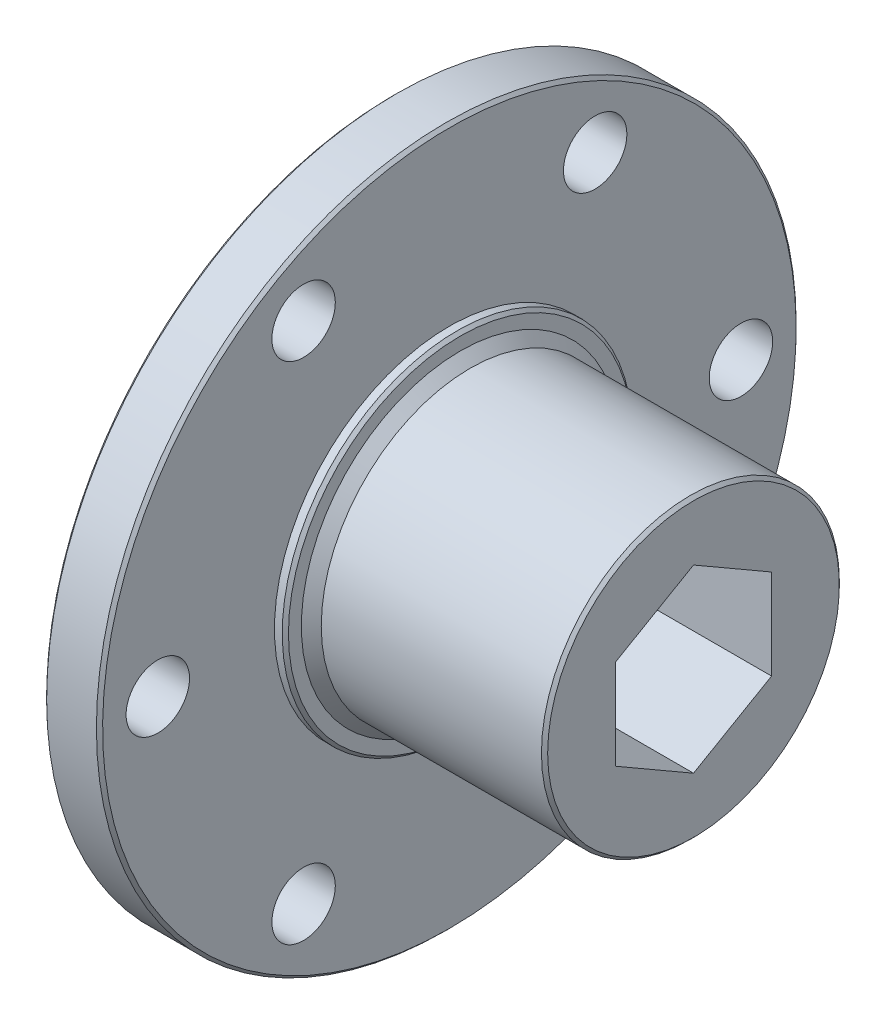
ISO-10303-21;
HEADER;
FILE_DESCRIPTION(('STEP AP214'),'2;1');
FILE_NAME('part.step','',(''),(''),'','','');
FILE_SCHEMA(('AUTOMOTIVE_DESIGN { 1 0 10303 214 1 1 1 1 }'));
ENDSEC;
DATA;
#1=APPLICATION_CONTEXT('core data for automotive mechanical design processes');
#2=APPLICATION_PROTOCOL_DEFINITION('international standard','automotive_design',2000,#1);
#3=PRODUCT_CONTEXT('',#1,'mechanical');
#4=PRODUCT('Part','Part','',(#3));
#5=PRODUCT_RELATED_PRODUCT_CATEGORY('part','',(#4));
#6=PRODUCT_DEFINITION_FORMATION('','',#4);
#7=PRODUCT_DEFINITION_CONTEXT('part definition',#1,'design');
#8=PRODUCT_DEFINITION('design','',#6,#7);
#9=PRODUCT_DEFINITION_SHAPE('','',#8);
#10=(LENGTH_UNIT() NAMED_UNIT(*) SI_UNIT(.MILLI.,.METRE.));
#11=(NAMED_UNIT(*) PLANE_ANGLE_UNIT() SI_UNIT($,.RADIAN.));
#12=(NAMED_UNIT(*) SI_UNIT($,.STERADIAN.) SOLID_ANGLE_UNIT());
#13=UNCERTAINTY_MEASURE_WITH_UNIT(LENGTH_MEASURE(1.E-05),#10,'distance_accuracy_value','');
#14=(GEOMETRIC_REPRESENTATION_CONTEXT(3) GLOBAL_UNCERTAINTY_ASSIGNED_CONTEXT((#13)) GLOBAL_UNIT_ASSIGNED_CONTEXT((#10,
#11,#12)) REPRESENTATION_CONTEXT('',''));
#15=CARTESIAN_POINT('',(0.,0.,0.));
#16=DIRECTION('',(0.,0.,1.));
#17=DIRECTION('',(1.,0.,0.));
#18=AXIS2_PLACEMENT_3D('',#15,#16,#17);
#19=CARTESIAN_POINT('',(6.01493375394323,0.,0.));
#20=DIRECTION('',(-1.,0.,0.));
#21=DIRECTION('',(0.,0.,1.));
#22=AXIS2_PLACEMENT_3D('',#19,#20,#21);
#23=CYLINDRICAL_SURFACE('',#22,12.1666);
#24=CARTESIAN_POINT('',(5.76093375394327,0.,0.));
#25=DIRECTION('',(-1.,0.,0.));
#26=DIRECTION('',(0.,0.,1.));
#27=AXIS2_PLACEMENT_3D('',#24,#25,#26);
#28=CIRCLE('',#27,12.1666);
#29=CARTESIAN_POINT('',(5.76093375394327,0.,12.1666));
#30=VERTEX_POINT('',#29);
#31=EDGE_CURVE('E101',#30,#30,#28,.F.);
#32=ORIENTED_EDGE('',*,*,#31,.F.);
#33=EDGE_LOOP('',(#32));
#34=FACE_BOUND('',#33,.T.);
#35=CARTESIAN_POINT('',(-12.2222662460567,0.,0.));
#36=DIRECTION('',(-1.,0.,0.));
#37=DIRECTION('',(0.,0.,1.));
#38=AXIS2_PLACEMENT_3D('',#35,#36,#37);
#39=CIRCLE('',#38,12.1666);
#40=CARTESIAN_POINT('',(-12.2222662460567,0.,12.1666));
#41=VERTEX_POINT('',#40);
#42=EDGE_CURVE('E98',#41,#41,#39,.T.);
#43=ORIENTED_EDGE('',*,*,#42,.F.);
#44=EDGE_LOOP('',(#43));
#45=FACE_BOUND('',#44,.T.);
#46=ADVANCED_FACE('F17',(#34,#45),#23,.T.);
#47=CARTESIAN_POINT('',(5.76093375394327,0.,0.));
#48=DIRECTION('',(-1.,0.,0.));
#49=DIRECTION('',(0.,0.,1.));
#50=AXIS2_PLACEMENT_3D('',#47,#48,#49);
#51=CONICAL_SURFACE('',#50,12.1666,0.785398163397465);
#52=ORIENTED_EDGE('',*,*,#31,.T.);
#53=EDGE_LOOP('',(#52));
#54=FACE_BOUND('',#53,.T.);
#55=CARTESIAN_POINT('',(6.01493375394323,0.,0.));
#56=DIRECTION('',(-1.,0.,0.));
#57=DIRECTION('',(0.,0.,1.));
#58=AXIS2_PLACEMENT_3D('',#55,#56,#57);
#59=CIRCLE('',#58,11.9126);
#60=CARTESIAN_POINT('',(6.01493375394323,0.,11.9126));
#61=VERTEX_POINT('',#60);
#62=EDGE_CURVE('E20',#61,#61,#59,.F.);
#63=ORIENTED_EDGE('',*,*,#62,.F.);
#64=EDGE_LOOP('',(#63));
#65=FACE_BOUND('',#64,.T.);
#66=ADVANCED_FACE('F164',(#54,#65),#51,.T.);
#67=CARTESIAN_POINT('',(-13.0350662460568,0.,0.));
#68=DIRECTION('',(-1.,0.,0.));
#69=DIRECTION('',(0.,-1.,0.));
#70=AXIS2_PLACEMENT_3D('',#67,#68,#69);
#71=CONICAL_SURFACE('',#70,12.9794,0.785398163397438);
#72=ORIENTED_EDGE('',*,*,#42,.T.);
#73=EDGE_LOOP('',(#72));
#74=FACE_BOUND('',#73,.T.);
#75=CARTESIAN_POINT('',(-13.0350662460568,0.,0.));
#76=DIRECTION('',(-1.,0.,0.));
#77=DIRECTION('',(0.,-1.,0.));
#78=AXIS2_PLACEMENT_3D('',#75,#76,#77);
#79=CIRCLE('',#78,12.9794);
#80=CARTESIAN_POINT('',(-13.0350662460568,-12.9794,0.));
#81=VERTEX_POINT('',#80);
#82=EDGE_CURVE('E83',#81,#81,#79,.T.);
#83=ORIENTED_EDGE('',*,*,#82,.F.);
#84=EDGE_LOOP('',(#83));
#85=FACE_BOUND('',#84,.T.);
#86=ADVANCED_FACE('F166',(#74,#85),#71,.T.);
#87=CARTESIAN_POINT('',(6.01493375394323,0.,0.));
#88=DIRECTION('',(1.,0.,0.));
#89=DIRECTION('',(0.,0.,-1.));
#90=AXIS2_PLACEMENT_3D('',#87,#88,#89);
#91=PLANE('',#90);
#92=DIRECTION('',(0.,1.,0.));
#93=VECTOR('',#92,1.);
#94=CARTESIAN_POINT('',(6.01493375394323,-3.68085890619153,-6.37539999999999));
#95=LINE('',#94,#93);
#96=CARTESIAN_POINT('',(6.01493375394323,3.68081890619155,-6.37539999999999));
#97=VERTEX_POINT('',#96);
#98=CARTESIAN_POINT('',(6.01493375394323,-3.68085890619153,-6.37539999999999));
#99=VERTEX_POINT('',#98);
#100=EDGE_CURVE('E92',#97,#99,#95,.F.);
#101=ORIENTED_EDGE('',*,*,#100,.T.);
#102=DIRECTION('',(0.,0.500000000000001,-0.866025403784438));
#103=VECTOR('',#102,1.);
#104=CARTESIAN_POINT('',(6.01493375394323,-7.36169781238308,0.));
#105=LINE('',#104,#103);
#106=CARTESIAN_POINT('',(6.01493375394323,-7.36169781238308,0.));
#107=VERTEX_POINT('',#106);
#108=EDGE_CURVE('E68',#99,#107,#105,.F.);
#109=ORIENTED_EDGE('',*,*,#108,.T.);
#110=DIRECTION('',(0.,-0.500000000000001,-0.866025403784438));
#111=VECTOR('',#110,1.);
#112=CARTESIAN_POINT('',(6.01493375394323,-3.68085890619153,6.3754));
#113=LINE('',#112,#111);
#114=CARTESIAN_POINT('',(6.01493375394323,-3.68085890619153,6.3754));
#115=VERTEX_POINT('',#114);
#116=EDGE_CURVE('E74',#107,#115,#113,.F.);
#117=ORIENTED_EDGE('',*,*,#116,.T.);
#118=DIRECTION('',(0.,-1.,0.));
#119=VECTOR('',#118,1.);
#120=CARTESIAN_POINT('',(6.01493375394323,3.68081890619155,6.3754));
#121=LINE('',#120,#119);
#122=CARTESIAN_POINT('',(6.01493375394323,3.68081890619155,6.3754));
#123=VERTEX_POINT('',#122);
#124=EDGE_CURVE('E157',#115,#123,#121,.F.);
#125=ORIENTED_EDGE('',*,*,#124,.T.);
#126=DIRECTION('',(0.,-0.500000000000001,0.866025403784438));
#127=VECTOR('',#126,1.);
#128=CARTESIAN_POINT('',(6.01493375394323,7.3616578123831,0.));
#129=LINE('',#128,#127);
#130=CARTESIAN_POINT('',(6.01493375394323,7.3616578123831,0.));
#131=VERTEX_POINT('',#130);
#132=EDGE_CURVE('E454',#123,#131,#129,.F.);
#133=ORIENTED_EDGE('',*,*,#132,.T.);
#134=DIRECTION('',(0.,0.500000000000001,0.866025403784438));
#135=VECTOR('',#134,1.);
#136=CARTESIAN_POINT('',(6.01493375394323,3.68081890619155,-6.37539999999999));
#137=LINE('',#136,#135);
#138=EDGE_CURVE('E460',#131,#97,#137,.F.);
#139=ORIENTED_EDGE('',*,*,#138,.T.);
#140=EDGE_LOOP('',(#101,#109,#117,#125,#133,#139));
#141=FACE_BOUND('',#140,.T.);
#142=ORIENTED_EDGE('',*,*,#62,.T.);
#143=EDGE_LOOP('',(#142));
#144=FACE_BOUND('',#143,.T.);
#145=ADVANCED_FACE('F89',(#141,#144),#91,.T.);
#146=CARTESIAN_POINT('',(-13.0350662460568,28.575,0.));
#147=DIRECTION('',(1.,0.,0.));
#148=DIRECTION('',(0.,0.,-1.));
#149=AXIS2_PLACEMENT_3D('',#146,#147,#148);
#150=PLANE('',#149);
#151=ORIENTED_EDGE('',*,*,#82,.T.);
#152=EDGE_LOOP('',(#151));
#153=FACE_BOUND('',#152,.T.);
#154=CARTESIAN_POINT('',(-13.0350662460568,0.,0.));
#155=DIRECTION('',(-1.,0.,0.));
#156=DIRECTION('',(0.,-1.,0.));
#157=AXIS2_PLACEMENT_3D('',#154,#155,#156);
#158=CIRCLE('',#157,14.0335);
#159=CARTESIAN_POINT('',(-13.0350662460568,-14.0335,0.));
#160=VERTEX_POINT('',#159);
#161=EDGE_CURVE('E154',#160,#160,#158,.T.);
#162=ORIENTED_EDGE('',*,*,#161,.F.);
#163=EDGE_LOOP('',(#162));
#164=FACE_BOUND('',#163,.T.);
#165=ADVANCED_FACE('F264',(#153,#164),#150,.T.);
#166=CARTESIAN_POINT('',(-19.3850662460568,-3.68085890619153,6.3754));
#167=DIRECTION('',(0.,-0.866025403784438,0.500000000000001));
#168=DIRECTION('',(0.,-0.500000000000001,-0.866025403784438));
#169=AXIS2_PLACEMENT_3D('',#166,#167,#168);
#170=PLANE('',#169);
#171=DIRECTION('',(1.,0.,0.));
#172=VECTOR('',#171,1.);
#173=CARTESIAN_POINT('',(-19.3850662460568,-7.36169781238308,0.));
#174=LINE('',#173,#172);
#175=CARTESIAN_POINT('',(-19.3850662460568,-7.36169781238308,0.));
#176=VERTEX_POINT('',#175);
#177=EDGE_CURVE('E77',#107,#176,#174,.F.);
#178=ORIENTED_EDGE('',*,*,#177,.T.);
#179=DIRECTION('',(0.,-0.500000000000001,-0.866025403784438));
#180=VECTOR('',#179,1.);
#181=CARTESIAN_POINT('',(-19.3850662460568,-3.68085890619153,6.3754));
#182=LINE('',#181,#180);
#183=CARTESIAN_POINT('',(-19.3850662460568,-3.68085890619153,6.3754));
#184=VERTEX_POINT('',#183);
#185=EDGE_CURVE('E156',#184,#176,#182,.T.);
#186=ORIENTED_EDGE('',*,*,#185,.F.);
#187=DIRECTION('',(1.,0.,0.));
#188=VECTOR('',#187,1.);
#189=CARTESIAN_POINT('',(-19.3850662460568,-3.68085890619153,6.3754));
#190=LINE('',#189,#188);
#191=EDGE_CURVE('E79',#184,#115,#190,.T.);
#192=ORIENTED_EDGE('',*,*,#191,.T.);
#193=ORIENTED_EDGE('',*,*,#116,.F.);
#194=EDGE_LOOP('',(#178,#186,#192,#193));
#195=FACE_BOUND('',#194,.T.);
#196=ADVANCED_FACE('F75',(#195),#170,.F.);
#197=CARTESIAN_POINT('',(-19.3850662460568,-7.36169781238308,0.));
#198=DIRECTION('',(0.,-0.866025403784438,-0.500000000000001));
#199=DIRECTION('',(0.,0.500000000000001,-0.866025403784438));
#200=AXIS2_PLACEMENT_3D('',#197,#198,#199);
#201=PLANE('',#200);
#202=DIRECTION('',(1.,0.,0.));
#203=VECTOR('',#202,1.);
#204=CARTESIAN_POINT('',(-19.3850662460568,-3.68085890619153,-6.37539999999999));
#205=LINE('',#204,#203);
#206=CARTESIAN_POINT('',(-19.3850662460568,-3.68085890619153,-6.37539999999999));
#207=VERTEX_POINT('',#206);
#208=EDGE_CURVE('E93',#99,#207,#205,.F.);
#209=ORIENTED_EDGE('',*,*,#208,.T.);
#210=DIRECTION('',(0.,0.500000000000001,-0.866025403784438));
#211=VECTOR('',#210,1.);
#212=CARTESIAN_POINT('',(-19.3850662460568,-7.36169781238308,0.));
#213=LINE('',#212,#211);
#214=EDGE_CURVE('E86',#176,#207,#213,.T.);
#215=ORIENTED_EDGE('',*,*,#214,.F.);
#216=ORIENTED_EDGE('',*,*,#177,.F.);
#217=ORIENTED_EDGE('',*,*,#108,.F.);
#218=EDGE_LOOP('',(#209,#215,#216,#217));
#219=FACE_BOUND('',#218,.T.);
#220=ADVANCED_FACE('F85',(#219),#201,.F.);
#221=CARTESIAN_POINT('',(-19.3850662460568,-3.68085890619153,-6.37539999999999));
#222=DIRECTION('',(0.,0.,-1.));
#223=DIRECTION('',(0.,1.,0.));
#224=AXIS2_PLACEMENT_3D('',#221,#222,#223);
#225=PLANE('',#224);
#226=DIRECTION('',(1.,0.,0.));
#227=VECTOR('',#226,1.);
#228=CARTESIAN_POINT('',(-19.3850662460568,3.68081890619155,-6.37539999999999));
#229=LINE('',#228,#227);
#230=CARTESIAN_POINT('',(-19.3850662460568,3.68081890619155,-6.37539999999999));
#231=VERTEX_POINT('',#230);
#232=EDGE_CURVE('E462',#97,#231,#229,.F.);
#233=ORIENTED_EDGE('',*,*,#232,.T.);
#234=DIRECTION('',(0.,1.,0.));
#235=VECTOR('',#234,1.);
#236=CARTESIAN_POINT('',(-19.3850662460568,0.,-6.37539999999999));
#237=LINE('',#236,#235);
#238=EDGE_CURVE('E467',#207,#231,#237,.T.);
#239=ORIENTED_EDGE('',*,*,#238,.F.);
#240=ORIENTED_EDGE('',*,*,#208,.F.);
#241=ORIENTED_EDGE('',*,*,#100,.F.);
#242=EDGE_LOOP('',(#233,#239,#240,#241));
#243=FACE_BOUND('',#242,.T.);
#244=ADVANCED_FACE('F255',(#243),#225,.F.);
#245=CARTESIAN_POINT('',(-19.3850662460568,3.68081890619155,-6.37539999999999));
#246=DIRECTION('',(0.,0.866025403784438,-0.500000000000001));
#247=DIRECTION('',(0.,0.500000000000001,0.866025403784438));
#248=AXIS2_PLACEMENT_3D('',#245,#246,#247);
#249=PLANE('',#248);
#250=DIRECTION('',(1.,0.,0.));
#251=VECTOR('',#250,1.);
#252=CARTESIAN_POINT('',(-19.3850662460568,7.3616578123831,0.));
#253=LINE('',#252,#251);
#254=CARTESIAN_POINT('',(-19.3850662460568,7.3616578123831,0.));
#255=VERTEX_POINT('',#254);
#256=EDGE_CURVE('E457',#131,#255,#253,.F.);
#257=ORIENTED_EDGE('',*,*,#256,.T.);
#258=DIRECTION('',(0.,0.500000000000001,0.866025403784438));
#259=VECTOR('',#258,1.);
#260=CARTESIAN_POINT('',(-19.3850662460568,3.68081890619155,-6.37539999999999));
#261=LINE('',#260,#259);
#262=EDGE_CURVE('E468',#231,#255,#261,.T.);
#263=ORIENTED_EDGE('',*,*,#262,.F.);
#264=ORIENTED_EDGE('',*,*,#232,.F.);
#265=ORIENTED_EDGE('',*,*,#138,.F.);
#266=EDGE_LOOP('',(#257,#263,#264,#265));
#267=FACE_BOUND('',#266,.T.);
#268=ADVANCED_FACE('F251',(#267),#249,.F.);
#269=CARTESIAN_POINT('',(-19.3850662460568,7.3616578123831,0.));
#270=DIRECTION('',(0.,0.866025403784438,0.500000000000001));
#271=DIRECTION('',(0.,-0.500000000000001,0.866025403784438));
#272=AXIS2_PLACEMENT_3D('',#269,#270,#271);
#273=PLANE('',#272);
#274=DIRECTION('',(1.,0.,0.));
#275=VECTOR('',#274,1.);
#276=CARTESIAN_POINT('',(-19.3850662460568,3.68081890619155,6.3754));
#277=LINE('',#276,#275);
#278=CARTESIAN_POINT('',(-19.3850662460568,3.68081890619155,6.3754));
#279=VERTEX_POINT('',#278);
#280=EDGE_CURVE('E452',#123,#279,#277,.F.);
#281=ORIENTED_EDGE('',*,*,#280,.T.);
#282=DIRECTION('',(0.,-0.500000000000001,0.866025403784438));
#283=VECTOR('',#282,1.);
#284=CARTESIAN_POINT('',(-19.3850662460568,7.3616578123831,0.));
#285=LINE('',#284,#283);
#286=EDGE_CURVE('E35',#255,#279,#285,.T.);
#287=ORIENTED_EDGE('',*,*,#286,.F.);
#288=ORIENTED_EDGE('',*,*,#256,.F.);
#289=ORIENTED_EDGE('',*,*,#132,.F.);
#290=EDGE_LOOP('',(#281,#287,#288,#289));
#291=FACE_BOUND('',#290,.T.);
#292=ADVANCED_FACE('F247',(#291),#273,.F.);
#293=CARTESIAN_POINT('',(-19.3850662460568,3.68081890619155,6.3754));
#294=DIRECTION('',(0.,0.,1.));
#295=DIRECTION('',(0.,-1.,0.));
#296=AXIS2_PLACEMENT_3D('',#293,#294,#295);
#297=PLANE('',#296);
#298=ORIENTED_EDGE('',*,*,#191,.F.);
#299=DIRECTION('',(0.,1.,0.));
#300=VECTOR('',#299,1.);
#301=CARTESIAN_POINT('',(-19.3850662460568,0.,6.3754));
#302=LINE('',#301,#300);
#303=EDGE_CURVE('E443',#279,#184,#302,.F.);
#304=ORIENTED_EDGE('',*,*,#303,.F.);
#305=ORIENTED_EDGE('',*,*,#280,.F.);
#306=ORIENTED_EDGE('',*,*,#124,.F.);
#307=EDGE_LOOP('',(#298,#304,#305,#306));
#308=FACE_BOUND('',#307,.T.);
#309=ADVANCED_FACE('F243',(#308),#297,.F.);
#310=CARTESIAN_POINT('',(-13.2890662460568,0.,0.));
#311=DIRECTION('',(-1.,0.,0.));
#312=DIRECTION('',(0.,-1.,0.));
#313=AXIS2_PLACEMENT_3D('',#310,#311,#312);
#314=CONICAL_SURFACE('',#313,14.2875,0.785398163397452);
#315=ORIENTED_EDGE('',*,*,#161,.T.);
#316=EDGE_LOOP('',(#315));
#317=FACE_BOUND('',#316,.T.);
#318=CARTESIAN_POINT('',(-13.2890662460568,0.,0.));
#319=DIRECTION('',(1.,0.,0.));
#320=DIRECTION('',(0.,0.,-1.));
#321=AXIS2_PLACEMENT_3D('',#318,#319,#320);
#322=CIRCLE('',#321,14.2875);
#323=CARTESIAN_POINT('',(-13.2890662460568,0.,-14.2875));
#324=VERTEX_POINT('',#323);
#325=EDGE_CURVE('E441',#324,#324,#322,.F.);
#326=ORIENTED_EDGE('',*,*,#325,.F.);
#327=EDGE_LOOP('',(#326));
#328=FACE_BOUND('',#327,.T.);
#329=ADVANCED_FACE('F240',(#317,#328),#314,.T.);
#330=CARTESIAN_POINT('',(-19.3850662460568,0.,0.));
#331=DIRECTION('',(-1.,0.,0.));
#332=DIRECTION('',(0.,0.,1.));
#333=AXIS2_PLACEMENT_3D('',#330,#331,#332);
#334=PLANE('',#333);
#335=ORIENTED_EDGE('',*,*,#286,.T.);
#336=ORIENTED_EDGE('',*,*,#303,.T.);
#337=ORIENTED_EDGE('',*,*,#185,.T.);
#338=ORIENTED_EDGE('',*,*,#214,.T.);
#339=ORIENTED_EDGE('',*,*,#238,.T.);
#340=ORIENTED_EDGE('',*,*,#262,.T.);
#341=EDGE_LOOP('',(#335,#336,#337,#338,#339,#340));
#342=FACE_BOUND('',#341,.T.);
#343=CARTESIAN_POINT('',(-19.3850662460568,0.,0.));
#344=DIRECTION('',(1.,0.,0.));
#345=DIRECTION('',(0.,0.,-1.));
#346=AXIS2_PLACEMENT_3D('',#343,#344,#345);
#347=CIRCLE('',#346,14.0335);
#348=CARTESIAN_POINT('',(-19.3850662460568,0.,-14.0335));
#349=VERTEX_POINT('',#348);
#350=EDGE_CURVE('E150',#349,#349,#347,.T.);
#351=ORIENTED_EDGE('',*,*,#350,.F.);
#352=EDGE_LOOP('',(#351));
#353=FACE_BOUND('',#352,.T.);
#354=ADVANCED_FACE('F236',(#342,#353),#334,.T.);
#355=CARTESIAN_POINT('',(-14.1780662460568,0.,0.));
#356=DIRECTION('',(-1.,0.,0.));
#357=DIRECTION('',(0.,-1.,0.));
#358=AXIS2_PLACEMENT_3D('',#355,#356,#357);
#359=CONICAL_SURFACE('',#358,28.575,0.785398163397445);
#360=CARTESIAN_POINT('',(-14.1780662460568,0.,0.));
#361=DIRECTION('',(-1.,0.,0.));
#362=DIRECTION('',(0.,0.,1.));
#363=AXIS2_PLACEMENT_3D('',#360,#361,#362);
#364=CIRCLE('',#363,28.575);
#365=CARTESIAN_POINT('',(-14.1780662460568,0.,28.575));
#366=VERTEX_POINT('',#365);
#367=EDGE_CURVE('E153',#366,#366,#364,.T.);
#368=ORIENTED_EDGE('',*,*,#367,.F.);
#369=EDGE_LOOP('',(#368));
#370=FACE_BOUND('',#369,.T.);
#371=CARTESIAN_POINT('',(-13.9240662460568,0.,0.));
#372=DIRECTION('',(-1.,0.,0.));
#373=DIRECTION('',(0.,-1.,0.));
#374=AXIS2_PLACEMENT_3D('',#371,#372,#373);
#375=CIRCLE('',#374,28.321);
#376=CARTESIAN_POINT('',(-13.9240662460568,-28.321,0.));
#377=VERTEX_POINT('',#376);
#378=EDGE_CURVE('E147',#377,#377,#375,.F.);
#379=ORIENTED_EDGE('',*,*,#378,.F.);
#380=EDGE_LOOP('',(#379));
#381=FACE_BOUND('',#380,.T.);
#382=ADVANCED_FACE('F232',(#370,#381),#359,.T.);
#383=CARTESIAN_POINT('',(14.3030238953624,0.,0.));
#384=DIRECTION('',(1.,0.,0.));
#385=DIRECTION('',(0.,0.,-1.));
#386=AXIS2_PLACEMENT_3D('',#383,#384,#385);
#387=CYLINDRICAL_SURFACE('',#386,14.2875);
#388=CARTESIAN_POINT('',(-13.9240662460568,0.,0.));
#389=DIRECTION('',(1.,0.,0.));
#390=DIRECTION('',(0.,0.,-1.));
#391=AXIS2_PLACEMENT_3D('',#388,#389,#390);
#392=CIRCLE('',#391,14.2875);
#393=CARTESIAN_POINT('',(-13.9240662460568,0.,-14.2875));
#394=VERTEX_POINT('',#393);
#395=EDGE_CURVE('E144',#394,#394,#392,.F.);
#396=ORIENTED_EDGE('',*,*,#395,.F.);
#397=EDGE_LOOP('',(#396));
#398=FACE_BOUND('',#397,.T.);
#399=ORIENTED_EDGE('',*,*,#325,.T.);
#400=EDGE_LOOP('',(#399));
#401=FACE_BOUND('',#400,.T.);
#402=ADVANCED_FACE('F228',(#398,#401),#387,.T.);
#403=CARTESIAN_POINT('',(-13.0350662460568,0.,0.));
#404=DIRECTION('',(-1.,0.,0.));
#405=DIRECTION('',(0.,0.,1.));
#406=AXIS2_PLACEMENT_3D('',#403,#404,#405);
#407=CYLINDRICAL_SURFACE('',#406,28.575);
#408=ORIENTED_EDGE('',*,*,#367,.T.);
#409=EDGE_LOOP('',(#408));
#410=FACE_BOUND('',#409,.T.);
#411=CARTESIAN_POINT('',(-18.2420662460568,0.,0.));
#412=DIRECTION('',(1.,0.,0.));
#413=DIRECTION('',(0.,0.,-1.));
#414=AXIS2_PLACEMENT_3D('',#411,#412,#413);
#415=CIRCLE('',#414,28.575);
#416=CARTESIAN_POINT('',(-18.2420662460568,0.,-28.575));
#417=VERTEX_POINT('',#416);
#418=EDGE_CURVE('E143',#417,#417,#415,.F.);
#419=ORIENTED_EDGE('',*,*,#418,.F.);
#420=EDGE_LOOP('',(#419));
#421=FACE_BOUND('',#420,.T.);
#422=ADVANCED_FACE('F224',(#410,#421),#407,.T.);
#423=CARTESIAN_POINT('',(-19.1310662460568,0.,0.));
#424=DIRECTION('',(1.,0.,0.));
#425=DIRECTION('',(0.,0.,-1.));
#426=AXIS2_PLACEMENT_3D('',#423,#424,#425);
#427=CONICAL_SURFACE('',#426,14.2875,0.785398163397452);
#428=CARTESIAN_POINT('',(-19.1310662460568,0.,0.));
#429=DIRECTION('',(1.,0.,0.));
#430=DIRECTION('',(0.,0.,-1.));
#431=AXIS2_PLACEMENT_3D('',#428,#429,#430);
#432=CIRCLE('',#431,14.2875);
#433=CARTESIAN_POINT('',(-19.1310662460568,0.,-14.2875));
#434=VERTEX_POINT('',#433);
#435=EDGE_CURVE('E133',#434,#434,#432,.T.);
#436=ORIENTED_EDGE('',*,*,#435,.F.);
#437=EDGE_LOOP('',(#436));
#438=FACE_BOUND('',#437,.T.);
#439=ORIENTED_EDGE('',*,*,#350,.T.);
#440=EDGE_LOOP('',(#439));
#441=FACE_BOUND('',#440,.T.);
#442=ADVANCED_FACE('F220',(#438,#441),#427,.T.);
#443=CARTESIAN_POINT('',(-13.9240662460568,0.,5.72637987752451));
#444=DIRECTION('',(1.,0.,0.));
#445=DIRECTION('',(0.,0.,-1.));
#446=AXIS2_PLACEMENT_3D('',#443,#444,#445);
#447=PLANE('',#446);
#448=CARTESIAN_POINT('',(-13.9240662460568,0.,23.8125));
#449=DIRECTION('',(1.,0.,0.));
#450=DIRECTION('',(0.,0.,-1.));
#451=AXIS2_PLACEMENT_3D('',#448,#449,#450);
#452=CIRCLE('',#451,2.59080000000001);
#453=CARTESIAN_POINT('',(-13.9240662460568,0.,21.2217));
#454=VERTEX_POINT('',#453);
#455=EDGE_CURVE('E124',#454,#454,#452,.F.);
#456=ORIENTED_EDGE('',*,*,#455,.T.);
#457=EDGE_LOOP('',(#456));
#458=FACE_BOUND('',#457,.T.);
#459=CARTESIAN_POINT('',(-13.9240662460568,20.622229927617,-11.90625));
#460=DIRECTION('',(1.,0.,0.));
#461=DIRECTION('',(0.,0.,-1.));
#462=AXIS2_PLACEMENT_3D('',#459,#460,#461);
#463=CIRCLE('',#462,2.59080000000001);
#464=CARTESIAN_POINT('',(-13.9240662460568,20.622229927617,-14.49705));
#465=VERTEX_POINT('',#464);
#466=EDGE_CURVE('E127',#465,#465,#463,.F.);
#467=ORIENTED_EDGE('',*,*,#466,.T.);
#468=EDGE_LOOP('',(#467));
#469=FACE_BOUND('',#468,.T.);
#470=CARTESIAN_POINT('',(-13.9240662460568,-20.6222299276169,-11.90625));
#471=DIRECTION('',(1.,0.,0.));
#472=DIRECTION('',(0.,0.,-1.));
#473=AXIS2_PLACEMENT_3D('',#470,#471,#472);
#474=CIRCLE('',#473,2.59080000000001);
#475=CARTESIAN_POINT('',(-13.9240662460568,-20.6222299276169,-14.4970500000001));
#476=VERTEX_POINT('',#475);
#477=EDGE_CURVE('E130',#476,#476,#474,.F.);
#478=ORIENTED_EDGE('',*,*,#477,.T.);
#479=EDGE_LOOP('',(#478));
#480=FACE_BOUND('',#479,.T.);
#481=ORIENTED_EDGE('',*,*,#395,.T.);
#482=EDGE_LOOP('',(#481));
#483=FACE_BOUND('',#482,.T.);
#484=CARTESIAN_POINT('',(-13.9240662460568,-20.622229927617,11.9062499999999));
#485=DIRECTION('',(1.,0.,0.));
#486=DIRECTION('',(0.,0.,-1.));
#487=AXIS2_PLACEMENT_3D('',#484,#485,#486);
#488=CIRCLE('',#487,2.59080000000001);
#489=CARTESIAN_POINT('',(-13.9240662460568,-20.622229927617,9.31544999999993));
#490=VERTEX_POINT('',#489);
#491=EDGE_CURVE('E134',#490,#490,#488,.F.);
#492=ORIENTED_EDGE('',*,*,#491,.T.);
#493=EDGE_LOOP('',(#492));
#494=FACE_BOUND('',#493,.T.);
#495=CARTESIAN_POINT('',(-13.9240662460568,0.,-23.8125));
#496=DIRECTION('',(1.,0.,0.));
#497=DIRECTION('',(0.,0.,-1.));
#498=AXIS2_PLACEMENT_3D('',#495,#496,#497);
#499=CIRCLE('',#498,2.59080000000001);
#500=CARTESIAN_POINT('',(-13.9240662460568,0.,-26.4033));
#501=VERTEX_POINT('',#500);
#502=EDGE_CURVE('E137',#501,#501,#499,.F.);
#503=ORIENTED_EDGE('',*,*,#502,.T.);
#504=EDGE_LOOP('',(#503));
#505=FACE_BOUND('',#504,.T.);
#506=CARTESIAN_POINT('',(-13.9240662460568,20.6222299276169,11.90625));
#507=DIRECTION('',(1.,0.,0.));
#508=DIRECTION('',(0.,0.,-1.));
#509=AXIS2_PLACEMENT_3D('',#506,#507,#508);
#510=CIRCLE('',#509,2.59080000000001);
#511=CARTESIAN_POINT('',(-13.9240662460568,20.6222299276169,9.31544999999999));
#512=VERTEX_POINT('',#511);
#513=EDGE_CURVE('E140',#512,#512,#510,.F.);
#514=ORIENTED_EDGE('',*,*,#513,.T.);
#515=EDGE_LOOP('',(#514));
#516=FACE_BOUND('',#515,.T.);
#517=ORIENTED_EDGE('',*,*,#378,.T.);
#518=EDGE_LOOP('',(#517));
#519=FACE_BOUND('',#518,.T.);
#520=ADVANCED_FACE('F216',(#458,#469,#480,#483,#494,#505,#516,#519),#447,.T.);
#521=CARTESIAN_POINT('',(-18.2420662460568,0.,0.));
#522=DIRECTION('',(1.,0.,0.));
#523=DIRECTION('',(0.,0.,-1.));
#524=AXIS2_PLACEMENT_3D('',#521,#522,#523);
#525=CONICAL_SURFACE('',#524,28.575,0.785398163397448);
#526=CARTESIAN_POINT('',(-18.4960662460568,0.,0.));
#527=DIRECTION('',(1.,0.,0.));
#528=DIRECTION('',(0.,0.,-1.));
#529=AXIS2_PLACEMENT_3D('',#526,#527,#528);
#530=CIRCLE('',#529,28.321);
#531=CARTESIAN_POINT('',(-18.4960662460568,0.,-28.321));
#532=VERTEX_POINT('',#531);
#533=EDGE_CURVE('E121',#532,#532,#530,.T.);
#534=ORIENTED_EDGE('',*,*,#533,.T.);
#535=EDGE_LOOP('',(#534));
#536=FACE_BOUND('',#535,.T.);
#537=ORIENTED_EDGE('',*,*,#418,.T.);
#538=EDGE_LOOP('',(#537));
#539=FACE_BOUND('',#538,.T.);
#540=ADVANCED_FACE('F212',(#536,#539),#525,.T.);
#541=CARTESIAN_POINT('',(-13.0350662460568,20.6222299276169,11.90625));
#542=DIRECTION('',(1.,0.,0.));
#543=DIRECTION('',(0.,0.,-1.));
#544=AXIS2_PLACEMENT_3D('',#541,#542,#543);
#545=CYLINDRICAL_SURFACE('',#544,2.59080000000001);
#546=ORIENTED_EDGE('',*,*,#513,.F.);
#547=EDGE_LOOP('',(#546));
#548=FACE_BOUND('',#547,.T.);
#549=CARTESIAN_POINT('',(-18.4960662460568,20.6222299276169,11.90625));
#550=DIRECTION('',(1.,0.,0.));
#551=DIRECTION('',(0.,0.,-1.));
#552=AXIS2_PLACEMENT_3D('',#549,#550,#551);
#553=CIRCLE('',#552,2.59080000000001);
#554=CARTESIAN_POINT('',(-18.4960662460568,20.6222299276169,9.31544999999999));
#555=VERTEX_POINT('',#554);
#556=EDGE_CURVE('E118',#555,#555,#553,.F.);
#557=ORIENTED_EDGE('',*,*,#556,.T.);
#558=EDGE_LOOP('',(#557));
#559=FACE_BOUND('',#558,.T.);
#560=ADVANCED_FACE('F208',(#548,#559),#545,.F.);
#561=CARTESIAN_POINT('',(-13.0350662460568,0.,-23.8125));
#562=DIRECTION('',(1.,0.,0.));
#563=DIRECTION('',(0.,0.,-1.));
#564=AXIS2_PLACEMENT_3D('',#561,#562,#563);
#565=CYLINDRICAL_SURFACE('',#564,2.59080000000001);
#566=ORIENTED_EDGE('',*,*,#502,.F.);
#567=EDGE_LOOP('',(#566));
#568=FACE_BOUND('',#567,.T.);
#569=CARTESIAN_POINT('',(-18.4960662460568,0.,-23.8125));
#570=DIRECTION('',(1.,0.,0.));
#571=DIRECTION('',(0.,0.,-1.));
#572=AXIS2_PLACEMENT_3D('',#569,#570,#571);
#573=CIRCLE('',#572,2.59080000000001);
#574=CARTESIAN_POINT('',(-18.4960662460568,0.,-26.4033));
#575=VERTEX_POINT('',#574);
#576=EDGE_CURVE('E115',#575,#575,#573,.F.);
#577=ORIENTED_EDGE('',*,*,#576,.T.);
#578=EDGE_LOOP('',(#577));
#579=FACE_BOUND('',#578,.T.);
#580=ADVANCED_FACE('F204',(#568,#579),#565,.F.);
#581=CARTESIAN_POINT('',(-13.0350662460568,-20.622229927617,11.9062499999999));
#582=DIRECTION('',(1.,0.,0.));
#583=DIRECTION('',(0.,0.,-1.));
#584=AXIS2_PLACEMENT_3D('',#581,#582,#583);
#585=CYLINDRICAL_SURFACE('',#584,2.59080000000001);
#586=ORIENTED_EDGE('',*,*,#491,.F.);
#587=EDGE_LOOP('',(#586));
#588=FACE_BOUND('',#587,.T.);
#589=CARTESIAN_POINT('',(-18.4960662460568,-20.622229927617,11.9062499999999));
#590=DIRECTION('',(1.,0.,0.));
#591=DIRECTION('',(0.,0.,-1.));
#592=AXIS2_PLACEMENT_3D('',#589,#590,#591);
#593=CIRCLE('',#592,2.59080000000001);
#594=CARTESIAN_POINT('',(-18.4960662460568,-20.622229927617,9.31544999999993));
#595=VERTEX_POINT('',#594);
#596=EDGE_CURVE('E112',#595,#595,#593,.F.);
#597=ORIENTED_EDGE('',*,*,#596,.T.);
#598=EDGE_LOOP('',(#597));
#599=FACE_BOUND('',#598,.T.);
#600=ADVANCED_FACE('F200',(#588,#599),#585,.F.);
#601=CARTESIAN_POINT('',(14.3030238953624,0.,0.));
#602=DIRECTION('',(1.,0.,0.));
#603=DIRECTION('',(0.,0.,-1.));
#604=AXIS2_PLACEMENT_3D('',#601,#602,#603);
#605=CYLINDRICAL_SURFACE('',#604,14.2875);
#606=CARTESIAN_POINT('',(-18.4960662460568,0.,0.));
#607=DIRECTION('',(1.,0.,0.));
#608=DIRECTION('',(0.,0.,-1.));
#609=AXIS2_PLACEMENT_3D('',#606,#607,#608);
#610=CIRCLE('',#609,14.2875);
#611=CARTESIAN_POINT('',(-18.4960662460568,0.,-14.2875));
#612=VERTEX_POINT('',#611);
#613=EDGE_CURVE('E109',#612,#612,#610,.F.);
#614=ORIENTED_EDGE('',*,*,#613,.T.);
#615=EDGE_LOOP('',(#614));
#616=FACE_BOUND('',#615,.T.);
#617=ORIENTED_EDGE('',*,*,#435,.T.);
#618=EDGE_LOOP('',(#617));
#619=FACE_BOUND('',#618,.T.);
#620=ADVANCED_FACE('F196',(#616,#619),#605,.T.);
#621=CARTESIAN_POINT('',(-13.0350662460568,-20.6222299276169,-11.90625));
#622=DIRECTION('',(1.,0.,0.));
#623=DIRECTION('',(0.,0.,-1.));
#624=AXIS2_PLACEMENT_3D('',#621,#622,#623);
#625=CYLINDRICAL_SURFACE('',#624,2.59080000000001);
#626=ORIENTED_EDGE('',*,*,#477,.F.);
#627=EDGE_LOOP('',(#626));
#628=FACE_BOUND('',#627,.T.);
#629=CARTESIAN_POINT('',(-18.4960662460568,-20.6222299276169,-11.90625));
#630=DIRECTION('',(1.,0.,0.));
#631=DIRECTION('',(0.,0.,-1.));
#632=AXIS2_PLACEMENT_3D('',#629,#630,#631);
#633=CIRCLE('',#632,2.59080000000001);
#634=CARTESIAN_POINT('',(-18.4960662460568,-20.6222299276169,-14.4970500000001));
#635=VERTEX_POINT('',#634);
#636=EDGE_CURVE('E106',#635,#635,#633,.F.);
#637=ORIENTED_EDGE('',*,*,#636,.T.);
#638=EDGE_LOOP('',(#637));
#639=FACE_BOUND('',#638,.T.);
#640=ADVANCED_FACE('F192',(#628,#639),#625,.F.);
#641=CARTESIAN_POINT('',(-13.0350662460568,20.622229927617,-11.90625));
#642=DIRECTION('',(1.,0.,0.));
#643=DIRECTION('',(0.,0.,-1.));
#644=AXIS2_PLACEMENT_3D('',#641,#642,#643);
#645=CYLINDRICAL_SURFACE('',#644,2.59080000000001);
#646=ORIENTED_EDGE('',*,*,#466,.F.);
#647=EDGE_LOOP('',(#646));
#648=FACE_BOUND('',#647,.T.);
#649=CARTESIAN_POINT('',(-18.4960662460568,20.622229927617,-11.90625));
#650=DIRECTION('',(1.,0.,0.));
#651=DIRECTION('',(0.,0.,-1.));
#652=AXIS2_PLACEMENT_3D('',#649,#650,#651);
#653=CIRCLE('',#652,2.59080000000001);
#654=CARTESIAN_POINT('',(-18.4960662460568,20.622229927617,-14.49705));
#655=VERTEX_POINT('',#654);
#656=EDGE_CURVE('E26',#655,#655,#653,.F.);
#657=ORIENTED_EDGE('',*,*,#656,.T.);
#658=EDGE_LOOP('',(#657));
#659=FACE_BOUND('',#658,.T.);
#660=ADVANCED_FACE('F184',(#648,#659),#645,.F.);
#661=CARTESIAN_POINT('',(-13.0350662460568,0.,23.8125));
#662=DIRECTION('',(1.,0.,0.));
#663=DIRECTION('',(0.,0.,-1.));
#664=AXIS2_PLACEMENT_3D('',#661,#662,#663);
#665=CYLINDRICAL_SURFACE('',#664,2.59080000000001);
#666=ORIENTED_EDGE('',*,*,#455,.F.);
#667=EDGE_LOOP('',(#666));
#668=FACE_BOUND('',#667,.T.);
#669=CARTESIAN_POINT('',(-18.4960662460568,0.,23.8125));
#670=DIRECTION('',(1.,0.,0.));
#671=DIRECTION('',(0.,0.,-1.));
#672=AXIS2_PLACEMENT_3D('',#669,#670,#671);
#673=CIRCLE('',#672,2.59080000000001);
#674=CARTESIAN_POINT('',(-18.4960662460568,0.,21.2217));
#675=VERTEX_POINT('',#674);
#676=EDGE_CURVE('E10',#675,#675,#673,.F.);
#677=ORIENTED_EDGE('',*,*,#676,.T.);
#678=EDGE_LOOP('',(#677));
#679=FACE_BOUND('',#678,.T.);
#680=ADVANCED_FACE('F178',(#668,#679),#665,.F.);
#681=CARTESIAN_POINT('',(-18.4960662460568,0.,14.2875));
#682=DIRECTION('',(1.,0.,0.));
#683=DIRECTION('',(0.,0.,-1.));
#684=AXIS2_PLACEMENT_3D('',#681,#682,#683);
#685=PLANE('',#684);
#686=ORIENTED_EDGE('',*,*,#676,.F.);
#687=EDGE_LOOP('',(#686));
#688=FACE_BOUND('',#687,.T.);
#689=ORIENTED_EDGE('',*,*,#656,.F.);
#690=EDGE_LOOP('',(#689));
#691=FACE_BOUND('',#690,.T.);
#692=ORIENTED_EDGE('',*,*,#636,.F.);
#693=EDGE_LOOP('',(#692));
#694=FACE_BOUND('',#693,.T.);
#695=ORIENTED_EDGE('',*,*,#613,.F.);
#696=EDGE_LOOP('',(#695));
#697=FACE_BOUND('',#696,.T.);
#698=ORIENTED_EDGE('',*,*,#596,.F.);
#699=EDGE_LOOP('',(#698));
#700=FACE_BOUND('',#699,.T.);
#701=ORIENTED_EDGE('',*,*,#576,.F.);
#702=EDGE_LOOP('',(#701));
#703=FACE_BOUND('',#702,.T.);
#704=ORIENTED_EDGE('',*,*,#556,.F.);
#705=EDGE_LOOP('',(#704));
#706=FACE_BOUND('',#705,.T.);
#707=ORIENTED_EDGE('',*,*,#533,.F.);
#708=EDGE_LOOP('',(#707));
#709=FACE_BOUND('',#708,.T.);
#710=ADVANCED_FACE('F176',(#688,#691,#694,#697,#700,#703,#706,#709),#685,.F.);
#711=CLOSED_SHELL('',(#46,#66,#86,#145,#165,#196,#220,#244,#268,#292,#309,#329,#354,#382,#402,
#422,#442,#520,#540,#560,#580,#600,#620,#640,#660,#680,#710));
#712=MANIFOLD_SOLID_BREP('B1',#711);
#713=ADVANCED_BREP_SHAPE_REPRESENTATION('',(#18,#712),#14);
#714=SHAPE_DEFINITION_REPRESENTATION(#9,#713);
ENDSEC;
END-ISO-10303-21;
